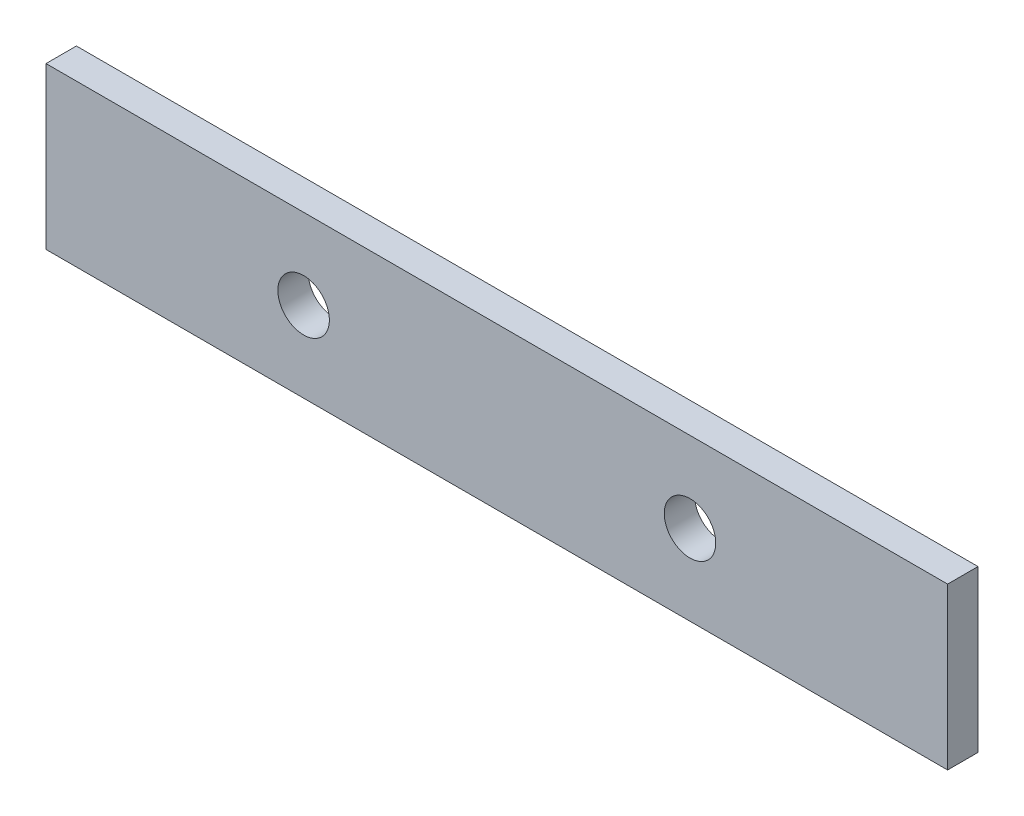
ISO-10303-21;
HEADER;
FILE_DESCRIPTION(('STEP AP214'),'2;1');
FILE_NAME('part.step','',(''),(''),'','','');
FILE_SCHEMA(('AUTOMOTIVE_DESIGN { 1 0 10303 214 1 1 1 1 }'));
ENDSEC;
DATA;
#1=APPLICATION_CONTEXT('core data for automotive mechanical design processes');
#2=APPLICATION_PROTOCOL_DEFINITION('international standard','automotive_design',2000,#1);
#3=PRODUCT_CONTEXT('',#1,'mechanical');
#4=PRODUCT('Part','Part','',(#3));
#5=PRODUCT_RELATED_PRODUCT_CATEGORY('part','',(#4));
#6=PRODUCT_DEFINITION_FORMATION('','',#4);
#7=PRODUCT_DEFINITION_CONTEXT('part definition',#1,'design');
#8=PRODUCT_DEFINITION('design','',#6,#7);
#9=PRODUCT_DEFINITION_SHAPE('','',#8);
#10=(LENGTH_UNIT() NAMED_UNIT(*) SI_UNIT(.MILLI.,.METRE.));
#11=(NAMED_UNIT(*) PLANE_ANGLE_UNIT() SI_UNIT($,.RADIAN.));
#12=(NAMED_UNIT(*) SI_UNIT($,.STERADIAN.) SOLID_ANGLE_UNIT());
#13=UNCERTAINTY_MEASURE_WITH_UNIT(LENGTH_MEASURE(1.E-05),#10,'distance_accuracy_value','');
#14=(GEOMETRIC_REPRESENTATION_CONTEXT(3) GLOBAL_UNCERTAINTY_ASSIGNED_CONTEXT((#13)) GLOBAL_UNIT_ASSIGNED_CONTEXT((#10,
#11,#12)) REPRESENTATION_CONTEXT('',''));
#15=CARTESIAN_POINT('',(0.,0.,0.));
#16=DIRECTION('',(0.,0.,1.));
#17=DIRECTION('',(1.,0.,0.));
#18=AXIS2_PLACEMENT_3D('',#15,#16,#17);
#19=CARTESIAN_POINT('',(44.45,-7.9375,1.4986));
#20=DIRECTION('',(-1.,0.,0.));
#21=DIRECTION('',(0.,0.,1.));
#22=AXIS2_PLACEMENT_3D('',#19,#20,#21);
#23=PLANE('',#22);
#24=DIRECTION('',(0.,1.,0.));
#25=VECTOR('',#24,1.);
#26=CARTESIAN_POINT('',(44.45,-7.9375,-1.4986));
#27=LINE('',#26,#25);
#28=CARTESIAN_POINT('',(44.45,-7.9375,-1.4986));
#29=VERTEX_POINT('',#28);
#30=CARTESIAN_POINT('',(44.45,7.9375,-1.4986));
#31=VERTEX_POINT('',#30);
#32=EDGE_CURVE('E94',#29,#31,#27,.T.);
#33=ORIENTED_EDGE('',*,*,#32,.T.);
#34=DIRECTION('',(0.,0.,-1.));
#35=VECTOR('',#34,1.);
#36=CARTESIAN_POINT('',(44.45,7.9375,1.4986));
#37=LINE('',#36,#35);
#38=CARTESIAN_POINT('',(44.45,7.9375,1.4986));
#39=VERTEX_POINT('',#38);
#40=EDGE_CURVE('E11',#39,#31,#37,.T.);
#41=ORIENTED_EDGE('',*,*,#40,.F.);
#42=DIRECTION('',(0.,1.,0.));
#43=VECTOR('',#42,1.);
#44=CARTESIAN_POINT('',(44.45,-7.9375,1.4986));
#45=LINE('',#44,#43);
#46=CARTESIAN_POINT('',(44.45,-7.9375,1.4986));
#47=VERTEX_POINT('',#46);
#48=EDGE_CURVE('E82',#47,#39,#45,.T.);
#49=ORIENTED_EDGE('',*,*,#48,.F.);
#50=DIRECTION('',(0.,0.,-1.));
#51=VECTOR('',#50,1.);
#52=CARTESIAN_POINT('',(44.45,-7.9375,1.4986));
#53=LINE('',#52,#51);
#54=EDGE_CURVE('E90',#47,#29,#53,.T.);
#55=ORIENTED_EDGE('',*,*,#54,.T.);
#56=EDGE_LOOP('',(#33,#41,#49,#55));
#57=FACE_BOUND('',#56,.T.);
#58=ADVANCED_FACE('F31',(#57),#23,.F.);
#59=CARTESIAN_POINT('',(-44.45,7.9375,1.4986));
#60=DIRECTION('',(0.,-1.,0.));
#61=DIRECTION('',(0.,0.,-1.));
#62=AXIS2_PLACEMENT_3D('',#59,#60,#61);
#63=PLANE('',#62);
#64=DIRECTION('',(-1.,0.,0.));
#65=VECTOR('',#64,1.);
#66=CARTESIAN_POINT('',(-44.45,7.9375,-1.4986));
#67=LINE('',#66,#65);
#68=CARTESIAN_POINT('',(-44.45,7.9375,-1.4986));
#69=VERTEX_POINT('',#68);
#70=EDGE_CURVE('E86',#31,#69,#67,.T.);
#71=ORIENTED_EDGE('',*,*,#70,.T.);
#72=DIRECTION('',(0.,0.,-1.));
#73=VECTOR('',#72,1.);
#74=CARTESIAN_POINT('',(-44.45,7.9375,1.4986));
#75=LINE('',#74,#73);
#76=CARTESIAN_POINT('',(-44.45,7.9375,1.4986));
#77=VERTEX_POINT('',#76);
#78=EDGE_CURVE('E39',#77,#69,#75,.T.);
#79=ORIENTED_EDGE('',*,*,#78,.F.);
#80=DIRECTION('',(-1.,0.,0.));
#81=VECTOR('',#80,1.);
#82=CARTESIAN_POINT('',(-44.45,7.9375,1.4986));
#83=LINE('',#82,#81);
#84=EDGE_CURVE('E77',#39,#77,#83,.T.);
#85=ORIENTED_EDGE('',*,*,#84,.F.);
#86=ORIENTED_EDGE('',*,*,#40,.T.);
#87=EDGE_LOOP('',(#71,#79,#85,#86));
#88=FACE_BOUND('',#87,.T.);
#89=ADVANCED_FACE('F85',(#88),#63,.F.);
#90=CARTESIAN_POINT('',(-44.45,-7.9375,1.4986));
#91=DIRECTION('',(1.,0.,0.));
#92=DIRECTION('',(0.,0.,-1.));
#93=AXIS2_PLACEMENT_3D('',#90,#91,#92);
#94=PLANE('',#93);
#95=DIRECTION('',(0.,-1.,0.));
#96=VECTOR('',#95,1.);
#97=CARTESIAN_POINT('',(-44.45,-7.9375,-1.4986));
#98=LINE('',#97,#96);
#99=CARTESIAN_POINT('',(-44.45,-7.9375,-1.4986));
#100=VERTEX_POINT('',#99);
#101=EDGE_CURVE('E64',#69,#100,#98,.T.);
#102=ORIENTED_EDGE('',*,*,#101,.T.);
#103=DIRECTION('',(0.,0.,-1.));
#104=VECTOR('',#103,1.);
#105=CARTESIAN_POINT('',(-44.45,-7.9375,1.4986));
#106=LINE('',#105,#104);
#107=CARTESIAN_POINT('',(-44.45,-7.9375,1.4986));
#108=VERTEX_POINT('',#107);
#109=EDGE_CURVE('E87',#108,#100,#106,.T.);
#110=ORIENTED_EDGE('',*,*,#109,.F.);
#111=DIRECTION('',(0.,-1.,0.));
#112=VECTOR('',#111,1.);
#113=CARTESIAN_POINT('',(-44.45,-7.9375,1.4986));
#114=LINE('',#113,#112);
#115=EDGE_CURVE('E80',#77,#108,#114,.T.);
#116=ORIENTED_EDGE('',*,*,#115,.F.);
#117=ORIENTED_EDGE('',*,*,#78,.T.);
#118=EDGE_LOOP('',(#102,#110,#116,#117));
#119=FACE_BOUND('',#118,.T.);
#120=ADVANCED_FACE('F88',(#119),#94,.F.);
#121=CARTESIAN_POINT('',(-44.45,-7.9375,1.4986));
#122=DIRECTION('',(0.,1.,0.));
#123=DIRECTION('',(0.,0.,1.));
#124=AXIS2_PLACEMENT_3D('',#121,#122,#123);
#125=PLANE('',#124);
#126=DIRECTION('',(1.,0.,0.));
#127=VECTOR('',#126,1.);
#128=CARTESIAN_POINT('',(-44.45,-7.9375,-1.4986));
#129=LINE('',#128,#127);
#130=EDGE_CURVE('E70',#100,#29,#129,.T.);
#131=ORIENTED_EDGE('',*,*,#130,.T.);
#132=ORIENTED_EDGE('',*,*,#54,.F.);
#133=DIRECTION('',(1.,0.,0.));
#134=VECTOR('',#133,1.);
#135=CARTESIAN_POINT('',(-44.45,-7.9375,1.4986));
#136=LINE('',#135,#134);
#137=EDGE_CURVE('E47',#108,#47,#136,.T.);
#138=ORIENTED_EDGE('',*,*,#137,.F.);
#139=ORIENTED_EDGE('',*,*,#109,.T.);
#140=EDGE_LOOP('',(#131,#132,#138,#139));
#141=FACE_BOUND('',#140,.T.);
#142=ADVANCED_FACE('F102',(#141),#125,.F.);
#143=CARTESIAN_POINT('',(44.45,7.9375,1.4986));
#144=DIRECTION('',(0.,0.,-1.));
#145=DIRECTION('',(-1.,0.,0.));
#146=AXIS2_PLACEMENT_3D('',#143,#144,#145);
#147=PLANE('',#146);
#148=CARTESIAN_POINT('',(-19.05,0.,1.4986));
#149=DIRECTION('',(0.,0.,-1.));
#150=DIRECTION('',(-1.,0.,0.));
#151=AXIS2_PLACEMENT_3D('',#148,#149,#150);
#152=CIRCLE('',#151,2.54);
#153=CARTESIAN_POINT('',(-21.59,0.,1.4986));
#154=VERTEX_POINT('',#153);
#155=EDGE_CURVE('E111',#154,#154,#152,.T.);
#156=ORIENTED_EDGE('',*,*,#155,.T.);
#157=EDGE_LOOP('',(#156));
#158=FACE_BOUND('',#157,.T.);
#159=CARTESIAN_POINT('',(19.05,0.,1.4986));
#160=DIRECTION('',(0.,0.,-1.));
#161=DIRECTION('',(-1.,0.,0.));
#162=AXIS2_PLACEMENT_3D('',#159,#160,#161);
#163=CIRCLE('',#162,2.54);
#164=CARTESIAN_POINT('',(16.51,0.,1.4986));
#165=VERTEX_POINT('',#164);
#166=EDGE_CURVE('E97',#165,#165,#163,.T.);
#167=ORIENTED_EDGE('',*,*,#166,.T.);
#168=EDGE_LOOP('',(#167));
#169=FACE_BOUND('',#168,.T.);
#170=ORIENTED_EDGE('',*,*,#48,.T.);
#171=ORIENTED_EDGE('',*,*,#84,.T.);
#172=ORIENTED_EDGE('',*,*,#115,.T.);
#173=ORIENTED_EDGE('',*,*,#137,.T.);
#174=EDGE_LOOP('',(#170,#171,#172,#173));
#175=FACE_BOUND('',#174,.T.);
#176=ADVANCED_FACE('F78',(#158,#169,#175),#147,.F.);
#177=CARTESIAN_POINT('',(44.45,7.9375,-1.4986));
#178=DIRECTION('',(0.,0.,-1.));
#179=DIRECTION('',(-1.,0.,0.));
#180=AXIS2_PLACEMENT_3D('',#177,#178,#179);
#181=PLANE('',#180);
#182=CARTESIAN_POINT('',(-19.05,0.,-1.4986));
#183=DIRECTION('',(0.,0.,-1.));
#184=DIRECTION('',(-1.,0.,0.));
#185=AXIS2_PLACEMENT_3D('',#182,#183,#184);
#186=CIRCLE('',#185,2.54);
#187=CARTESIAN_POINT('',(-21.59,0.,-1.4986));
#188=VERTEX_POINT('',#187);
#189=EDGE_CURVE('E114',#188,#188,#186,.T.);
#190=ORIENTED_EDGE('',*,*,#189,.F.);
#191=EDGE_LOOP('',(#190));
#192=FACE_BOUND('',#191,.T.);
#193=CARTESIAN_POINT('',(19.05,0.,-1.4986));
#194=DIRECTION('',(0.,0.,-1.));
#195=DIRECTION('',(-1.,0.,0.));
#196=AXIS2_PLACEMENT_3D('',#193,#194,#195);
#197=CIRCLE('',#196,2.54);
#198=CARTESIAN_POINT('',(16.51,0.,-1.4986));
#199=VERTEX_POINT('',#198);
#200=EDGE_CURVE('E108',#199,#199,#197,.T.);
#201=ORIENTED_EDGE('',*,*,#200,.F.);
#202=EDGE_LOOP('',(#201));
#203=FACE_BOUND('',#202,.T.);
#204=ORIENTED_EDGE('',*,*,#32,.F.);
#205=ORIENTED_EDGE('',*,*,#130,.F.);
#206=ORIENTED_EDGE('',*,*,#101,.F.);
#207=ORIENTED_EDGE('',*,*,#70,.F.);
#208=EDGE_LOOP('',(#204,#205,#206,#207));
#209=FACE_BOUND('',#208,.T.);
#210=ADVANCED_FACE('F105',(#192,#203,#209),#181,.T.);
#211=CARTESIAN_POINT('',(19.05,0.,1.4986));
#212=DIRECTION('',(0.,0.,-1.));
#213=DIRECTION('',(-1.,0.,0.));
#214=AXIS2_PLACEMENT_3D('',#211,#212,#213);
#215=CYLINDRICAL_SURFACE('',#214,2.54);
#216=ORIENTED_EDGE('',*,*,#166,.F.);
#217=EDGE_LOOP('',(#216));
#218=FACE_BOUND('',#217,.T.);
#219=ORIENTED_EDGE('',*,*,#200,.T.);
#220=EDGE_LOOP('',(#219));
#221=FACE_BOUND('',#220,.T.);
#222=ADVANCED_FACE('F125',(#218,#221),#215,.F.);
#223=CARTESIAN_POINT('',(-19.05,0.,1.4986));
#224=DIRECTION('',(0.,0.,-1.));
#225=DIRECTION('',(-1.,0.,0.));
#226=AXIS2_PLACEMENT_3D('',#223,#224,#225);
#227=CYLINDRICAL_SURFACE('',#226,2.54);
#228=ORIENTED_EDGE('',*,*,#155,.F.);
#229=EDGE_LOOP('',(#228));
#230=FACE_BOUND('',#229,.T.);
#231=ORIENTED_EDGE('',*,*,#189,.T.);
#232=EDGE_LOOP('',(#231));
#233=FACE_BOUND('',#232,.T.);
#234=ADVANCED_FACE('F122',(#230,#233),#227,.F.);
#235=CLOSED_SHELL('',(#58,#89,#120,#142,#176,#210,#222,#234));
#236=MANIFOLD_SOLID_BREP('B2',#235);
#237=ADVANCED_BREP_SHAPE_REPRESENTATION('',(#18,#236),#14);
#238=SHAPE_DEFINITION_REPRESENTATION(#9,#237);
ENDSEC;
END-ISO-10303-21;
